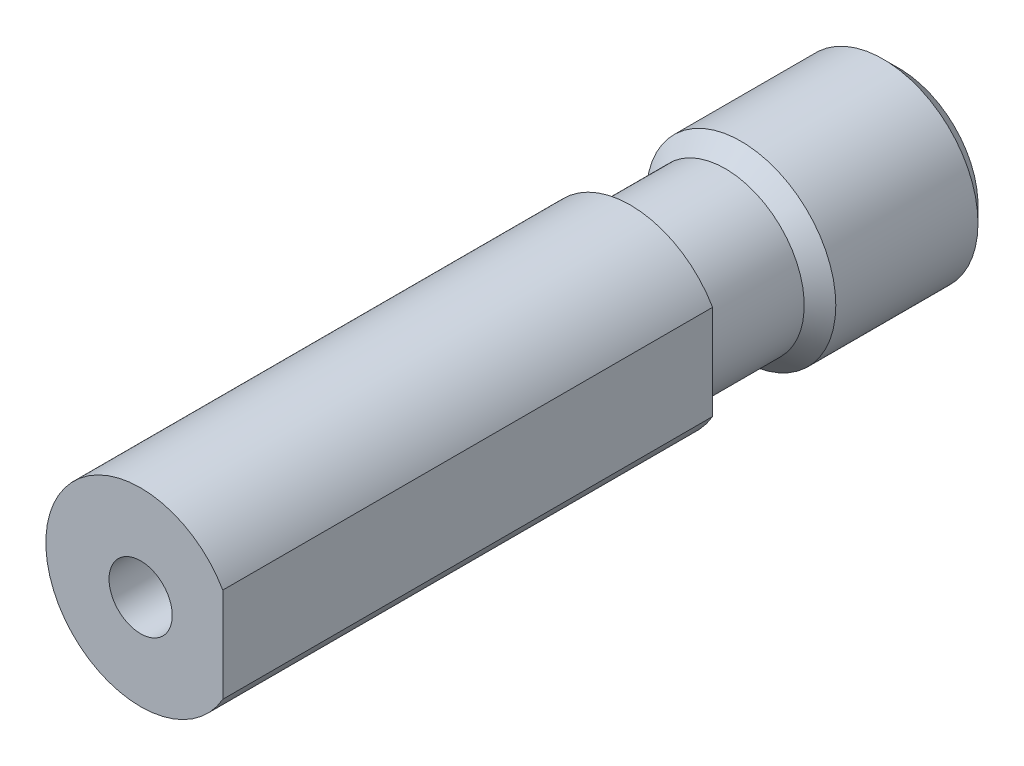
ISO-10303-21;
HEADER;
FILE_DESCRIPTION(('STEP AP214'),'2;1');
FILE_NAME('part.step','',(''),(''),'','','');
FILE_SCHEMA(('AUTOMOTIVE_DESIGN { 1 0 10303 214 1 1 1 1 }'));
ENDSEC;
DATA;
#1=APPLICATION_CONTEXT('core data for automotive mechanical design processes');
#2=APPLICATION_PROTOCOL_DEFINITION('international standard','automotive_design',2000,#1);
#3=PRODUCT_CONTEXT('',#1,'mechanical');
#4=PRODUCT('Part','Part','',(#3));
#5=PRODUCT_RELATED_PRODUCT_CATEGORY('part','',(#4));
#6=PRODUCT_DEFINITION_FORMATION('','',#4);
#7=PRODUCT_DEFINITION_CONTEXT('part definition',#1,'design');
#8=PRODUCT_DEFINITION('design','',#6,#7);
#9=PRODUCT_DEFINITION_SHAPE('','',#8);
#10=(LENGTH_UNIT() NAMED_UNIT(*) SI_UNIT(.MILLI.,.METRE.));
#11=(NAMED_UNIT(*) PLANE_ANGLE_UNIT() SI_UNIT($,.RADIAN.));
#12=(NAMED_UNIT(*) SI_UNIT($,.STERADIAN.) SOLID_ANGLE_UNIT());
#13=UNCERTAINTY_MEASURE_WITH_UNIT(LENGTH_MEASURE(1.E-05),#10,'distance_accuracy_value','');
#14=(GEOMETRIC_REPRESENTATION_CONTEXT(3) GLOBAL_UNCERTAINTY_ASSIGNED_CONTEXT((#13)) GLOBAL_UNIT_ASSIGNED_CONTEXT((#10,
#11,#12)) REPRESENTATION_CONTEXT('',''));
#15=CARTESIAN_POINT('',(0.,0.,0.));
#16=DIRECTION('',(0.,0.,1.));
#17=DIRECTION('',(1.,0.,0.));
#18=AXIS2_PLACEMENT_3D('',#15,#16,#17);
#19=CARTESIAN_POINT('',(0.,0.,24.));
#20=DIRECTION('',(0.,0.,-1.));
#21=DIRECTION('',(-1.,0.,0.));
#22=AXIS2_PLACEMENT_3D('',#19,#20,#21);
#23=CYLINDRICAL_SURFACE('',#22,3.);
#24=CARTESIAN_POINT('',(0.,0.,8.5));
#25=DIRECTION('',(0.,0.,-1.));
#26=DIRECTION('',(-1.,0.,0.));
#27=AXIS2_PLACEMENT_3D('',#24,#25,#26);
#28=CIRCLE('',#27,3.);
#29=CARTESIAN_POINT('',(2.6,-1.49666295470958,8.5));
#30=VERTEX_POINT('',#29);
#31=CARTESIAN_POINT('',(2.6,1.49666295470958,8.5));
#32=VERTEX_POINT('',#31);
#33=EDGE_CURVE('E67',#30,#32,#28,.T.);
#34=ORIENTED_EDGE('',*,*,#33,.F.);
#35=DIRECTION('',(0.,0.,-1.));
#36=VECTOR('',#35,1.);
#37=CARTESIAN_POINT('',(2.6,-1.49666295470958,24.));
#38=LINE('',#37,#36);
#39=CARTESIAN_POINT('',(2.6,-1.49666295470958,24.));
#40=VERTEX_POINT('',#39);
#41=EDGE_CURVE('E49',#40,#30,#38,.T.);
#42=ORIENTED_EDGE('',*,*,#41,.F.);
#43=CARTESIAN_POINT('',(0.,0.,24.));
#44=DIRECTION('',(0.,0.,-1.));
#45=DIRECTION('',(-1.,0.,0.));
#46=AXIS2_PLACEMENT_3D('',#43,#44,#45);
#47=CIRCLE('',#46,3.);
#48=CARTESIAN_POINT('',(2.6,1.49666295470958,24.));
#49=VERTEX_POINT('',#48);
#50=EDGE_CURVE('E72',#40,#49,#47,.T.);
#51=ORIENTED_EDGE('',*,*,#50,.T.);
#52=DIRECTION('',(0.,0.,-1.));
#53=VECTOR('',#52,1.);
#54=CARTESIAN_POINT('',(2.6,1.49666295470958,24.));
#55=LINE('',#54,#53);
#56=EDGE_CURVE('E55',#49,#32,#55,.T.);
#57=ORIENTED_EDGE('',*,*,#56,.T.);
#58=EDGE_LOOP('',(#34,#42,#51,#57));
#59=FACE_BOUND('',#58,.T.);
#60=ADVANCED_FACE('F32',(#59),#23,.T.);
#61=CARTESIAN_POINT('',(2.6,1.49666295470958,24.));
#62=DIRECTION('',(1.,0.,0.));
#63=DIRECTION('',(0.,0.,-1.));
#64=AXIS2_PLACEMENT_3D('',#61,#62,#63);
#65=PLANE('',#64);
#66=DIRECTION('',(0.,-1.,0.));
#67=VECTOR('',#66,1.);
#68=CARTESIAN_POINT('',(2.6,1.49666295470958,8.5));
#69=LINE('',#68,#67);
#70=EDGE_CURVE('E62',#32,#30,#69,.T.);
#71=ORIENTED_EDGE('',*,*,#70,.F.);
#72=ORIENTED_EDGE('',*,*,#56,.F.);
#73=DIRECTION('',(0.,-1.,0.));
#74=VECTOR('',#73,1.);
#75=CARTESIAN_POINT('',(2.6,1.49666295470958,24.));
#76=LINE('',#75,#74);
#77=EDGE_CURVE('E64',#49,#40,#76,.T.);
#78=ORIENTED_EDGE('',*,*,#77,.T.);
#79=ORIENTED_EDGE('',*,*,#41,.T.);
#80=EDGE_LOOP('',(#71,#72,#78,#79));
#81=FACE_BOUND('',#80,.T.);
#82=ADVANCED_FACE('F60',(#81),#65,.T.);
#83=CARTESIAN_POINT('',(0.,0.,24.));
#84=DIRECTION('',(0.,0.,-1.));
#85=DIRECTION('',(-1.,0.,0.));
#86=AXIS2_PLACEMENT_3D('',#83,#84,#85);
#87=PLANE('',#86);
#88=CARTESIAN_POINT('',(0.,0.,24.));
#89=DIRECTION('',(0.,0.,-1.));
#90=DIRECTION('',(-1.,0.,0.));
#91=AXIS2_PLACEMENT_3D('',#88,#89,#90);
#92=CIRCLE('',#91,1.);
#93=CARTESIAN_POINT('',(-1.,0.,24.));
#94=VERTEX_POINT('',#93);
#95=EDGE_CURVE('E90',#94,#94,#92,.T.);
#96=ORIENTED_EDGE('',*,*,#95,.T.);
#97=EDGE_LOOP('',(#96));
#98=FACE_BOUND('',#97,.T.);
#99=ORIENTED_EDGE('',*,*,#50,.F.);
#100=ORIENTED_EDGE('',*,*,#77,.F.);
#101=EDGE_LOOP('',(#99,#100));
#102=FACE_BOUND('',#101,.T.);
#103=ADVANCED_FACE('F122',(#98,#102),#87,.F.);
#104=CARTESIAN_POINT('',(0.,0.,8.5));
#105=DIRECTION('',(0.,0.,-1.));
#106=DIRECTION('',(-1.,0.,0.));
#107=AXIS2_PLACEMENT_3D('',#104,#105,#106);
#108=PLANE('',#107);
#109=CARTESIAN_POINT('',(0.,0.,8.5));
#110=DIRECTION('',(0.,0.,-1.));
#111=DIRECTION('',(-1.,0.,0.));
#112=AXIS2_PLACEMENT_3D('',#109,#110,#111);
#113=CIRCLE('',#112,2.5);
#114=CARTESIAN_POINT('',(-2.5,0.,8.5));
#115=VERTEX_POINT('',#114);
#116=EDGE_CURVE('E65',#115,#115,#113,.T.);
#117=ORIENTED_EDGE('',*,*,#116,.F.);
#118=EDGE_LOOP('',(#117));
#119=FACE_BOUND('',#118,.T.);
#120=ORIENTED_EDGE('',*,*,#33,.T.);
#121=ORIENTED_EDGE('',*,*,#70,.T.);
#122=EDGE_LOOP('',(#120,#121));
#123=FACE_BOUND('',#122,.T.);
#124=ADVANCED_FACE('F71',(#119,#123),#108,.T.);
#125=CARTESIAN_POINT('',(0.,0.,8.5));
#126=DIRECTION('',(0.,0.,-1.));
#127=DIRECTION('',(-1.,0.,0.));
#128=AXIS2_PLACEMENT_3D('',#125,#126,#127);
#129=CYLINDRICAL_SURFACE('',#128,2.5);
#130=ORIENTED_EDGE('',*,*,#116,.T.);
#131=EDGE_LOOP('',(#130));
#132=FACE_BOUND('',#131,.T.);
#133=CARTESIAN_POINT('',(0.,0.,5.49999999998363));
#134=DIRECTION('',(0.,0.,-1.));
#135=DIRECTION('',(-1.,0.,0.));
#136=AXIS2_PLACEMENT_3D('',#133,#134,#135);
#137=CIRCLE('',#136,2.5);
#138=CARTESIAN_POINT('',(-2.5,0.,5.49999999998363));
#139=VERTEX_POINT('',#138);
#140=EDGE_CURVE('E87',#139,#139,#137,.T.);
#141=ORIENTED_EDGE('',*,*,#140,.F.);
#142=EDGE_LOOP('',(#141));
#143=FACE_BOUND('',#142,.T.);
#144=ADVANCED_FACE('F108',(#132,#143),#129,.T.);
#145=CARTESIAN_POINT('',(0.,0.,0.));
#146=DIRECTION('',(0.,0.,-1.));
#147=DIRECTION('',(-1.,0.,0.));
#148=AXIS2_PLACEMENT_3D('',#145,#146,#147);
#149=PLANE('',#148);
#150=CARTESIAN_POINT('',(0.,0.,0.));
#151=DIRECTION('',(0.,0.,-1.));
#152=DIRECTION('',(-1.,0.,0.));
#153=AXIS2_PLACEMENT_3D('',#150,#151,#152);
#154=CIRCLE('',#153,2.5000000000332);
#155=CARTESIAN_POINT('',(-2.5000000000332,0.,0.));
#156=VERTEX_POINT('',#155);
#157=EDGE_CURVE('E41',#156,#156,#154,.T.);
#158=ORIENTED_EDGE('',*,*,#157,.T.);
#159=EDGE_LOOP('',(#158));
#160=FACE_BOUND('',#159,.T.);
#161=CARTESIAN_POINT('',(0.,0.,0.));
#162=DIRECTION('',(0.,0.,-1.));
#163=DIRECTION('',(-1.,0.,0.));
#164=AXIS2_PLACEMENT_3D('',#161,#162,#163);
#165=CIRCLE('',#164,1.99999999999999);
#166=CARTESIAN_POINT('',(-1.99999999999999,0.,0.));
#167=VERTEX_POINT('',#166);
#168=EDGE_CURVE('E99',#167,#167,#165,.T.);
#169=ORIENTED_EDGE('',*,*,#168,.F.);
#170=EDGE_LOOP('',(#169));
#171=FACE_BOUND('',#170,.T.);
#172=ADVANCED_FACE('F105',(#160,#171),#149,.T.);
#173=CARTESIAN_POINT('',(0.,0.,8.5));
#174=DIRECTION('',(0.,0.,-1.));
#175=DIRECTION('',(-1.,0.,0.));
#176=AXIS2_PLACEMENT_3D('',#173,#174,#175);
#177=CYLINDRICAL_SURFACE('',#176,3.00000000002137);
#178=CARTESIAN_POINT('',(0.,0.,0.499999999988178));
#179=DIRECTION('',(0.,0.,-1.));
#180=DIRECTION('',(-1.,0.,0.));
#181=AXIS2_PLACEMENT_3D('',#178,#179,#180);
#182=CIRCLE('',#181,3.00000000002137);
#183=CARTESIAN_POINT('',(-3.00000000002137,0.,0.499999999988178));
#184=VERTEX_POINT('',#183);
#185=EDGE_CURVE('E11',#184,#184,#182,.F.);
#186=ORIENTED_EDGE('',*,*,#185,.T.);
#187=EDGE_LOOP('',(#186));
#188=FACE_BOUND('',#187,.T.);
#189=CARTESIAN_POINT('',(0.,0.,4.99999999996226));
#190=DIRECTION('',(0.,0.,-1.));
#191=DIRECTION('',(-1.,0.,0.));
#192=AXIS2_PLACEMENT_3D('',#189,#190,#191);
#193=CIRCLE('',#192,3.00000000002137);
#194=CARTESIAN_POINT('',(-3.00000000002137,0.,4.99999999996226));
#195=VERTEX_POINT('',#194);
#196=EDGE_CURVE('E69',#195,#195,#193,.T.);
#197=ORIENTED_EDGE('',*,*,#196,.T.);
#198=EDGE_LOOP('',(#197));
#199=FACE_BOUND('',#198,.T.);
#200=ADVANCED_FACE('F107',(#188,#199),#177,.T.);
#201=CARTESIAN_POINT('',(0.,0.,4.99999999996226));
#202=DIRECTION('',(0.,0.,-1.));
#203=DIRECTION('',(-1.,0.,0.));
#204=AXIS2_PLACEMENT_3D('',#201,#202,#203);
#205=CONICAL_SURFACE('',#204,3.00000000002137,0.785398163397448);
#206=ORIENTED_EDGE('',*,*,#140,.T.);
#207=EDGE_LOOP('',(#206));
#208=FACE_BOUND('',#207,.T.);
#209=ORIENTED_EDGE('',*,*,#196,.F.);
#210=EDGE_LOOP('',(#209));
#211=FACE_BOUND('',#210,.T.);
#212=ADVANCED_FACE('F114',(#208,#211),#205,.T.);
#213=CARTESIAN_POINT('',(0.,0.,0.));
#214=DIRECTION('',(0.,0.,-1.));
#215=DIRECTION('',(-1.,0.,0.));
#216=AXIS2_PLACEMENT_3D('',#213,#214,#215);
#217=CYLINDRICAL_SURFACE('',#216,1.);
#218=ORIENTED_EDGE('',*,*,#95,.F.);
#219=EDGE_LOOP('',(#218));
#220=FACE_BOUND('',#219,.T.);
#221=CARTESIAN_POINT('',(0.,0.,22.));
#222=DIRECTION('',(0.,0.,-1.));
#223=DIRECTION('',(-1.,0.,0.));
#224=AXIS2_PLACEMENT_3D('',#221,#222,#223);
#225=CIRCLE('',#224,1.);
#226=CARTESIAN_POINT('',(-1.,0.,22.));
#227=VERTEX_POINT('',#226);
#228=EDGE_CURVE('E93',#227,#227,#225,.T.);
#229=ORIENTED_EDGE('',*,*,#228,.T.);
#230=EDGE_LOOP('',(#229));
#231=FACE_BOUND('',#230,.T.);
#232=ADVANCED_FACE('F135',(#220,#231),#217,.F.);
#233=CARTESIAN_POINT('',(1.,0.,22.));
#234=DIRECTION('',(0.,0.,1.));
#235=DIRECTION('',(1.,0.,0.));
#236=AXIS2_PLACEMENT_3D('',#233,#234,#235);
#237=PLANE('',#236);
#238=ORIENTED_EDGE('',*,*,#228,.F.);
#239=EDGE_LOOP('',(#238));
#240=FACE_BOUND('',#239,.T.);
#241=CARTESIAN_POINT('',(0.,0.,22.));
#242=DIRECTION('',(0.,0.,-1.));
#243=DIRECTION('',(-1.,0.,0.));
#244=AXIS2_PLACEMENT_3D('',#241,#242,#243);
#245=CIRCLE('',#244,1.99999999999999);
#246=CARTESIAN_POINT('',(-1.99999999999999,0.,22.));
#247=VERTEX_POINT('',#246);
#248=EDGE_CURVE('E96',#247,#247,#245,.T.);
#249=ORIENTED_EDGE('',*,*,#248,.T.);
#250=EDGE_LOOP('',(#249));
#251=FACE_BOUND('',#250,.T.);
#252=ADVANCED_FACE('F138',(#240,#251),#237,.F.);
#253=CARTESIAN_POINT('',(0.,0.,0.));
#254=DIRECTION('',(0.,0.,-1.));
#255=DIRECTION('',(-1.,0.,0.));
#256=AXIS2_PLACEMENT_3D('',#253,#254,#255);
#257=CYLINDRICAL_SURFACE('',#256,1.99999999999999);
#258=ORIENTED_EDGE('',*,*,#248,.F.);
#259=EDGE_LOOP('',(#258));
#260=FACE_BOUND('',#259,.T.);
#261=ORIENTED_EDGE('',*,*,#168,.T.);
#262=EDGE_LOOP('',(#261));
#263=FACE_BOUND('',#262,.T.);
#264=ADVANCED_FACE('F103',(#260,#263),#257,.F.);
#265=CARTESIAN_POINT('',(0.,0.,0.));
#266=DIRECTION('',(0.,0.,1.));
#267=DIRECTION('',(1.,0.,0.));
#268=AXIS2_PLACEMENT_3D('',#265,#266,#267);
#269=CONICAL_SURFACE('',#268,2.5000000000332,0.785398163397445);
#270=ORIENTED_EDGE('',*,*,#185,.F.);
#271=EDGE_LOOP('',(#270));
#272=FACE_BOUND('',#271,.T.);
#273=ORIENTED_EDGE('',*,*,#157,.F.);
#274=EDGE_LOOP('',(#273));
#275=FACE_BOUND('',#274,.T.);
#276=ADVANCED_FACE('F34',(#272,#275),#269,.T.);
#277=CLOSED_SHELL('',(#60,#82,#103,#124,#144,#172,#200,#212,#232,#252,#264,#276));
#278=MANIFOLD_SOLID_BREP('B2',#277);
#279=ADVANCED_BREP_SHAPE_REPRESENTATION('',(#18,#278),#14);
#280=SHAPE_DEFINITION_REPRESENTATION(#9,#279);
ENDSEC;
END-ISO-10303-21;
